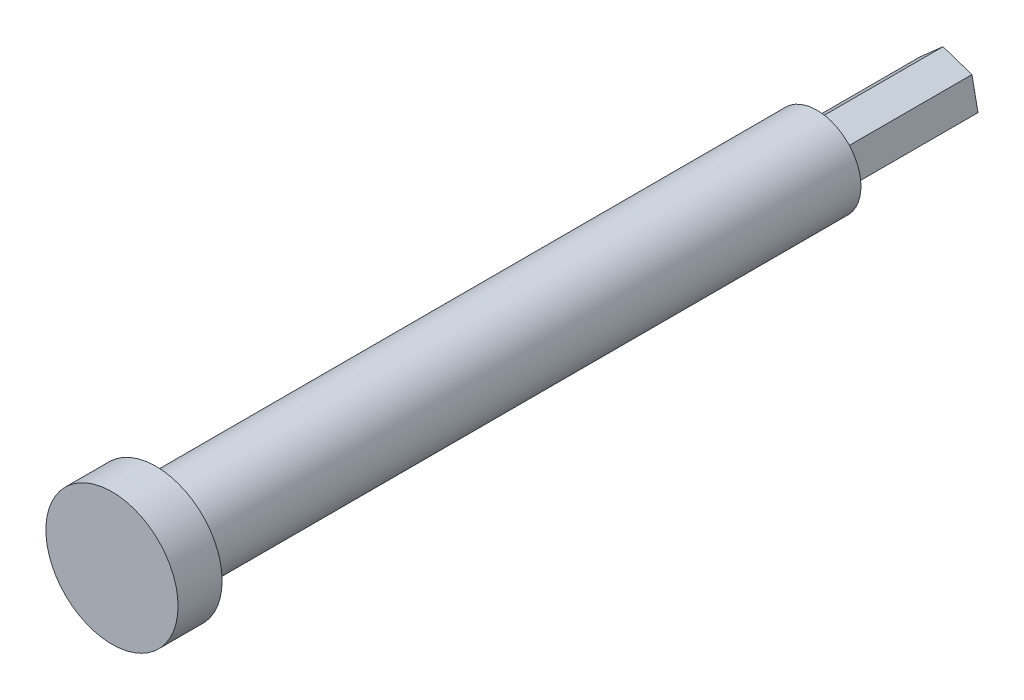
ISO-10303-21;
HEADER;
FILE_DESCRIPTION(('STEP AP214'),'2;1');
FILE_NAME('part.step','',(''),(''),'','','');
FILE_SCHEMA(('AUTOMOTIVE_DESIGN { 1 0 10303 214 1 1 1 1 }'));
ENDSEC;
DATA;
#1=APPLICATION_CONTEXT('core data for automotive mechanical design processes');
#2=APPLICATION_PROTOCOL_DEFINITION('international standard','automotive_design',2000,#1);
#3=PRODUCT_CONTEXT('',#1,'mechanical');
#4=PRODUCT('Part','Part','',(#3));
#5=PRODUCT_RELATED_PRODUCT_CATEGORY('part','',(#4));
#6=PRODUCT_DEFINITION_FORMATION('','',#4);
#7=PRODUCT_DEFINITION_CONTEXT('part definition',#1,'design');
#8=PRODUCT_DEFINITION('design','',#6,#7);
#9=PRODUCT_DEFINITION_SHAPE('','',#8);
#10=(LENGTH_UNIT() NAMED_UNIT(*) SI_UNIT(.MILLI.,.METRE.));
#11=(NAMED_UNIT(*) PLANE_ANGLE_UNIT() SI_UNIT($,.RADIAN.));
#12=(NAMED_UNIT(*) SI_UNIT($,.STERADIAN.) SOLID_ANGLE_UNIT());
#13=UNCERTAINTY_MEASURE_WITH_UNIT(LENGTH_MEASURE(1.E-05),#10,'distance_accuracy_value','');
#14=(GEOMETRIC_REPRESENTATION_CONTEXT(3) GLOBAL_UNCERTAINTY_ASSIGNED_CONTEXT((#13)) GLOBAL_UNIT_ASSIGNED_CONTEXT((#10,
#11,#12)) REPRESENTATION_CONTEXT('',''));
#15=CARTESIAN_POINT('',(0.,0.,0.));
#16=DIRECTION('',(0.,0.,1.));
#17=DIRECTION('',(1.,0.,0.));
#18=AXIS2_PLACEMENT_3D('',#15,#16,#17);
#19=CARTESIAN_POINT('',(2.59714864054017,2.29233918496812,15.));
#20=DIRECTION('',(-0.318416498756227,-0.947950912927366,0.));
#21=DIRECTION('',(0.947950912927366,-0.318416498756227,0.));
#22=AXIS2_PLACEMENT_3D('',#19,#20,#21);
#23=PLANE('',#22);
#24=DIRECTION('',(-0.947950912927366,0.318416498756227,0.));
#25=VECTOR('',#24,1.);
#26=CARTESIAN_POINT('',(2.59714864054017,2.29233918496812,0.));
#27=LINE('',#26,#25);
#28=CARTESIAN_POINT('',(2.59714864054017,2.29233918496812,0.));
#29=VERTEX_POINT('',#28);
#30=CARTESIAN_POINT('',(-0.686649648002819,3.39536629259607,0.));
#31=VERTEX_POINT('',#30);
#32=EDGE_CURVE('E124',#29,#31,#27,.T.);
#33=ORIENTED_EDGE('',*,*,#32,.T.);
#34=DIRECTION('',(0.,0.,-1.));
#35=VECTOR('',#34,1.);
#36=CARTESIAN_POINT('',(-0.686649648002819,3.39536629259607,15.));
#37=LINE('',#36,#35);
#38=CARTESIAN_POINT('',(-0.686649648002819,3.39536629259607,15.));
#39=VERTEX_POINT('',#38);
#40=EDGE_CURVE('E11',#39,#31,#37,.T.);
#41=ORIENTED_EDGE('',*,*,#40,.F.);
#42=DIRECTION('',(-0.947950912927366,0.318416498756227,0.));
#43=VECTOR('',#42,1.);
#44=CARTESIAN_POINT('',(2.59714864054017,2.29233918496812,15.));
#45=LINE('',#44,#43);
#46=CARTESIAN_POINT('',(2.59714864054017,2.29233918496812,15.));
#47=VERTEX_POINT('',#46);
#48=EDGE_CURVE('E116',#47,#39,#45,.T.);
#49=ORIENTED_EDGE('',*,*,#48,.F.);
#50=DIRECTION('',(0.,0.,-1.));
#51=VECTOR('',#50,1.);
#52=CARTESIAN_POINT('',(2.59714864054017,2.29233918496812,15.));
#53=LINE('',#52,#51);
#54=EDGE_CURVE('E123',#47,#29,#53,.T.);
#55=ORIENTED_EDGE('',*,*,#54,.T.);
#56=EDGE_LOOP('',(#33,#41,#49,#55));
#57=FACE_BOUND('',#56,.T.);
#58=ADVANCED_FACE('F33',(#57),#23,.F.);
#59=CARTESIAN_POINT('',(-0.686649648002819,3.39536629259607,15.));
#60=DIRECTION('',(0.661741322757637,-0.74973223337067,0.));
#61=DIRECTION('',(0.74973223337067,0.661741322757637,0.));
#62=AXIS2_PLACEMENT_3D('',#59,#60,#61);
#63=PLANE('',#62);
#64=DIRECTION('',(-0.74973223337067,-0.661741322757637,0.));
#65=VECTOR('',#64,1.);
#66=CARTESIAN_POINT('',(-0.686649648002819,3.39536629259607,0.));
#67=LINE('',#66,#65);
#68=CARTESIAN_POINT('',(-3.28379828854299,1.10302710762795,0.));
#69=VERTEX_POINT('',#68);
#70=EDGE_CURVE('E127',#31,#69,#67,.T.);
#71=ORIENTED_EDGE('',*,*,#70,.T.);
#72=DIRECTION('',(0.,0.,-1.));
#73=VECTOR('',#72,1.);
#74=CARTESIAN_POINT('',(-3.28379828854299,1.10302710762795,15.));
#75=LINE('',#74,#73);
#76=CARTESIAN_POINT('',(-3.28379828854299,1.10302710762795,15.));
#77=VERTEX_POINT('',#76);
#78=EDGE_CURVE('E41',#77,#69,#75,.T.);
#79=ORIENTED_EDGE('',*,*,#78,.F.);
#80=DIRECTION('',(-0.74973223337067,-0.661741322757637,0.));
#81=VECTOR('',#80,1.);
#82=CARTESIAN_POINT('',(-0.686649648002819,3.39536629259607,15.));
#83=LINE('',#82,#81);
#84=EDGE_CURVE('E85',#39,#77,#83,.T.);
#85=ORIENTED_EDGE('',*,*,#84,.F.);
#86=ORIENTED_EDGE('',*,*,#40,.T.);
#87=EDGE_LOOP('',(#71,#79,#85,#86));
#88=FACE_BOUND('',#87,.T.);
#89=ADVANCED_FACE('F184',(#88),#63,.F.);
#90=CARTESIAN_POINT('',(-3.28379828854299,1.10302710762795,15.));
#91=DIRECTION('',(0.980157821513862,0.198218679556695,0.));
#92=DIRECTION('',(-0.198218679556695,0.980157821513862,0.));
#93=AXIS2_PLACEMENT_3D('',#90,#91,#92);
#94=PLANE('',#93);
#95=DIRECTION('',(0.198218679556695,-0.980157821513862,0.));
#96=VECTOR('',#95,1.);
#97=CARTESIAN_POINT('',(-3.28379828854299,1.10302710762795,0.));
#98=LINE('',#97,#96);
#99=CARTESIAN_POINT('',(-2.59714864054017,-2.29233918496812,0.));
#100=VERTEX_POINT('',#99);
#101=EDGE_CURVE('E100',#69,#100,#98,.T.);
#102=ORIENTED_EDGE('',*,*,#101,.T.);
#103=DIRECTION('',(0.,0.,-1.));
#104=VECTOR('',#103,1.);
#105=CARTESIAN_POINT('',(-2.59714864054017,-2.29233918496812,15.));
#106=LINE('',#105,#104);
#107=CARTESIAN_POINT('',(-2.59714864054017,-2.29233918496812,15.));
#108=VERTEX_POINT('',#107);
#109=EDGE_CURVE('E93',#108,#100,#106,.T.);
#110=ORIENTED_EDGE('',*,*,#109,.F.);
#111=DIRECTION('',(0.198218679556695,-0.980157821513862,0.));
#112=VECTOR('',#111,1.);
#113=CARTESIAN_POINT('',(-3.28379828854299,1.10302710762795,15.));
#114=LINE('',#113,#112);
#115=EDGE_CURVE('E98',#77,#108,#114,.T.);
#116=ORIENTED_EDGE('',*,*,#115,.F.);
#117=ORIENTED_EDGE('',*,*,#78,.T.);
#118=EDGE_LOOP('',(#102,#110,#116,#117));
#119=FACE_BOUND('',#118,.T.);
#120=ADVANCED_FACE('F95',(#119),#94,.F.);
#121=CARTESIAN_POINT('',(-2.59714864054017,-2.29233918496812,15.));
#122=DIRECTION('',(0.318416498756226,0.947950912927366,0.));
#123=DIRECTION('',(-0.947950912927366,0.318416498756226,0.));
#124=AXIS2_PLACEMENT_3D('',#121,#122,#123);
#125=PLANE('',#124);
#126=DIRECTION('',(0.947950912927366,-0.318416498756226,0.));
#127=VECTOR('',#126,1.);
#128=CARTESIAN_POINT('',(-2.59714864054017,-2.29233918496812,0.));
#129=LINE('',#128,#127);
#130=CARTESIAN_POINT('',(0.686649648002809,-3.39536629259606,0.));
#131=VERTEX_POINT('',#130);
#132=EDGE_CURVE('E131',#100,#131,#129,.T.);
#133=ORIENTED_EDGE('',*,*,#132,.T.);
#134=DIRECTION('',(0.,0.,-1.));
#135=VECTOR('',#134,1.);
#136=CARTESIAN_POINT('',(0.686649648002809,-3.39536629259606,15.));
#137=LINE('',#136,#135);
#138=CARTESIAN_POINT('',(0.686649648002809,-3.39536629259606,15.));
#139=VERTEX_POINT('',#138);
#140=EDGE_CURVE('E103',#139,#131,#137,.T.);
#141=ORIENTED_EDGE('',*,*,#140,.F.);
#142=DIRECTION('',(0.947950912927366,-0.318416498756226,0.));
#143=VECTOR('',#142,1.);
#144=CARTESIAN_POINT('',(-2.59714864054017,-2.29233918496812,15.));
#145=LINE('',#144,#143);
#146=EDGE_CURVE('E106',#108,#139,#145,.T.);
#147=ORIENTED_EDGE('',*,*,#146,.F.);
#148=ORIENTED_EDGE('',*,*,#109,.T.);
#149=EDGE_LOOP('',(#133,#141,#147,#148));
#150=FACE_BOUND('',#149,.T.);
#151=ADVANCED_FACE('F107',(#150),#125,.F.);
#152=CARTESIAN_POINT('',(0.686649648002809,-3.39536629259606,15.));
#153=DIRECTION('',(-0.661741322757635,0.749732233370671,0.));
#154=DIRECTION('',(-0.749732233370672,-0.661741322757635,0.));
#155=AXIS2_PLACEMENT_3D('',#152,#153,#154);
#156=PLANE('',#155);
#157=DIRECTION('',(0.749732233370671,0.661741322757635,0.));
#158=VECTOR('',#157,1.);
#159=CARTESIAN_POINT('',(0.686649648002809,-3.39536629259606,0.));
#160=LINE('',#159,#158);
#161=CARTESIAN_POINT('',(3.28379828854299,-1.10302710762795,0.));
#162=VERTEX_POINT('',#161);
#163=EDGE_CURVE('E71',#131,#162,#160,.T.);
#164=ORIENTED_EDGE('',*,*,#163,.T.);
#165=DIRECTION('',(0.,0.,-1.));
#166=VECTOR('',#165,1.);
#167=CARTESIAN_POINT('',(3.28379828854299,-1.10302710762795,15.));
#168=LINE('',#167,#166);
#169=CARTESIAN_POINT('',(3.28379828854299,-1.10302710762795,15.));
#170=VERTEX_POINT('',#169);
#171=EDGE_CURVE('E49',#170,#162,#168,.T.);
#172=ORIENTED_EDGE('',*,*,#171,.F.);
#173=DIRECTION('',(0.749732233370671,0.661741322757635,0.));
#174=VECTOR('',#173,1.);
#175=CARTESIAN_POINT('',(0.686649648002809,-3.39536629259606,15.));
#176=LINE('',#175,#174);
#177=EDGE_CURVE('E110',#139,#170,#176,.T.);
#178=ORIENTED_EDGE('',*,*,#177,.F.);
#179=ORIENTED_EDGE('',*,*,#140,.T.);
#180=EDGE_LOOP('',(#164,#172,#178,#179));
#181=FACE_BOUND('',#180,.T.);
#182=ADVANCED_FACE('F140',(#181),#156,.F.);
#183=CARTESIAN_POINT('',(3.28379828854299,-1.10302710762795,15.));
#184=DIRECTION('',(-0.980157821513862,-0.198218679556695,0.));
#185=DIRECTION('',(0.198218679556695,-0.980157821513862,0.));
#186=AXIS2_PLACEMENT_3D('',#183,#184,#185);
#187=PLANE('',#186);
#188=DIRECTION('',(-0.198218679556695,0.980157821513862,0.));
#189=VECTOR('',#188,1.);
#190=CARTESIAN_POINT('',(3.28379828854299,-1.10302710762795,0.));
#191=LINE('',#190,#189);
#192=EDGE_CURVE('E77',#162,#29,#191,.T.);
#193=ORIENTED_EDGE('',*,*,#192,.T.);
#194=ORIENTED_EDGE('',*,*,#54,.F.);
#195=DIRECTION('',(-0.198218679556695,0.980157821513862,0.));
#196=VECTOR('',#195,1.);
#197=CARTESIAN_POINT('',(3.28379828854299,-1.10302710762795,15.));
#198=LINE('',#197,#196);
#199=EDGE_CURVE('E121',#170,#47,#198,.T.);
#200=ORIENTED_EDGE('',*,*,#199,.F.);
#201=ORIENTED_EDGE('',*,*,#171,.T.);
#202=EDGE_LOOP('',(#193,#194,#200,#201));
#203=FACE_BOUND('',#202,.T.);
#204=ADVANCED_FACE('F142',(#203),#187,.F.);
#205=CARTESIAN_POINT('',(0.,0.,0.));
#206=DIRECTION('',(0.,0.,1.));
#207=DIRECTION('',(1.,0.,0.));
#208=AXIS2_PLACEMENT_3D('',#205,#206,#207);
#209=PLANE('',#208);
#210=ORIENTED_EDGE('',*,*,#32,.F.);
#211=ORIENTED_EDGE('',*,*,#192,.F.);
#212=ORIENTED_EDGE('',*,*,#163,.F.);
#213=ORIENTED_EDGE('',*,*,#132,.F.);
#214=ORIENTED_EDGE('',*,*,#101,.F.);
#215=ORIENTED_EDGE('',*,*,#70,.F.);
#216=EDGE_LOOP('',(#210,#211,#212,#213,#214,#215));
#217=FACE_BOUND('',#216,.T.);
#218=ADVANCED_FACE('F139',(#217),#209,.F.);
#219=CARTESIAN_POINT('',(0.,0.,15.));
#220=DIRECTION('',(0.,0.,1.));
#221=DIRECTION('',(1.,0.,0.));
#222=AXIS2_PLACEMENT_3D('',#219,#220,#221);
#223=PLANE('',#222);
#224=CARTESIAN_POINT('',(0.,0.,15.));
#225=DIRECTION('',(0.,0.,1.));
#226=DIRECTION('',(1.,0.,0.));
#227=AXIS2_PLACEMENT_3D('',#224,#225,#226);
#228=CIRCLE('',#227,5.);
#229=CARTESIAN_POINT('',(5.,0.,15.));
#230=VERTEX_POINT('',#229);
#231=EDGE_CURVE('E145',#230,#230,#228,.T.);
#232=ORIENTED_EDGE('',*,*,#231,.F.);
#233=EDGE_LOOP('',(#232));
#234=FACE_BOUND('',#233,.T.);
#235=ORIENTED_EDGE('',*,*,#199,.T.);
#236=ORIENTED_EDGE('',*,*,#48,.T.);
#237=ORIENTED_EDGE('',*,*,#84,.T.);
#238=ORIENTED_EDGE('',*,*,#115,.T.);
#239=ORIENTED_EDGE('',*,*,#146,.T.);
#240=ORIENTED_EDGE('',*,*,#177,.T.);
#241=EDGE_LOOP('',(#235,#236,#237,#238,#239,#240));
#242=FACE_BOUND('',#241,.T.);
#243=ADVANCED_FACE('F113',(#234,#242),#223,.F.);
#244=CARTESIAN_POINT('',(0.,0.,90.));
#245=DIRECTION('',(0.,0.,-1.));
#246=DIRECTION('',(-1.,0.,0.));
#247=AXIS2_PLACEMENT_3D('',#244,#245,#246);
#248=CYLINDRICAL_SURFACE('',#247,5.);
#249=CARTESIAN_POINT('',(0.,0.,90.));
#250=DIRECTION('',(0.,0.,1.));
#251=DIRECTION('',(1.,0.,0.));
#252=AXIS2_PLACEMENT_3D('',#249,#250,#251);
#253=CIRCLE('',#252,5.);
#254=CARTESIAN_POINT('',(5.,0.,90.));
#255=VERTEX_POINT('',#254);
#256=EDGE_CURVE('E128',#255,#255,#253,.T.);
#257=ORIENTED_EDGE('',*,*,#256,.F.);
#258=EDGE_LOOP('',(#257));
#259=FACE_BOUND('',#258,.T.);
#260=ORIENTED_EDGE('',*,*,#231,.T.);
#261=EDGE_LOOP('',(#260));
#262=FACE_BOUND('',#261,.T.);
#263=ADVANCED_FACE('F168',(#259,#262),#248,.T.);
#264=CARTESIAN_POINT('',(0.,0.,90.));
#265=DIRECTION('',(0.,0.,1.));
#266=DIRECTION('',(1.,0.,0.));
#267=AXIS2_PLACEMENT_3D('',#264,#265,#266);
#268=PLANE('',#267);
#269=CARTESIAN_POINT('',(0.,0.,90.));
#270=DIRECTION('',(0.,0.,1.));
#271=DIRECTION('',(1.,0.,0.));
#272=AXIS2_PLACEMENT_3D('',#269,#270,#271);
#273=CIRCLE('',#272,7.5);
#274=CARTESIAN_POINT('',(7.5,0.,90.));
#275=VERTEX_POINT('',#274);
#276=EDGE_CURVE('E151',#275,#275,#273,.T.);
#277=ORIENTED_EDGE('',*,*,#276,.F.);
#278=EDGE_LOOP('',(#277));
#279=FACE_BOUND('',#278,.T.);
#280=ORIENTED_EDGE('',*,*,#256,.T.);
#281=EDGE_LOOP('',(#280));
#282=FACE_BOUND('',#281,.T.);
#283=ADVANCED_FACE('F162',(#279,#282),#268,.F.);
#284=CARTESIAN_POINT('',(0.,0.,95.));
#285=DIRECTION('',(0.,0.,-1.));
#286=DIRECTION('',(-1.,0.,0.));
#287=AXIS2_PLACEMENT_3D('',#284,#285,#286);
#288=CYLINDRICAL_SURFACE('',#287,7.5);
#289=CARTESIAN_POINT('',(0.,0.,95.));
#290=DIRECTION('',(0.,0.,1.));
#291=DIRECTION('',(1.,0.,0.));
#292=AXIS2_PLACEMENT_3D('',#289,#290,#291);
#293=CIRCLE('',#292,7.5);
#294=CARTESIAN_POINT('',(7.5,0.,95.));
#295=VERTEX_POINT('',#294);
#296=EDGE_CURVE('E148',#295,#295,#293,.T.);
#297=ORIENTED_EDGE('',*,*,#296,.F.);
#298=EDGE_LOOP('',(#297));
#299=FACE_BOUND('',#298,.T.);
#300=ORIENTED_EDGE('',*,*,#276,.T.);
#301=EDGE_LOOP('',(#300));
#302=FACE_BOUND('',#301,.T.);
#303=ADVANCED_FACE('F159',(#299,#302),#288,.T.);
#304=CARTESIAN_POINT('',(0.,0.,95.));
#305=DIRECTION('',(0.,0.,1.));
#306=DIRECTION('',(1.,0.,0.));
#307=AXIS2_PLACEMENT_3D('',#304,#305,#306);
#308=PLANE('',#307);
#309=ORIENTED_EDGE('',*,*,#296,.T.);
#310=EDGE_LOOP('',(#309));
#311=FACE_BOUND('',#310,.T.);
#312=ADVANCED_FACE('F157',(#311),#308,.T.);
#313=CLOSED_SHELL('',(#58,#89,#120,#151,#182,#204,#218,#243,#263,#283,#303,#312));
#314=MANIFOLD_SOLID_BREP('B2',#313);
#315=ADVANCED_BREP_SHAPE_REPRESENTATION('',(#18,#314),#14);
#316=SHAPE_DEFINITION_REPRESENTATION(#9,#315);
ENDSEC;
END-ISO-10303-21;
